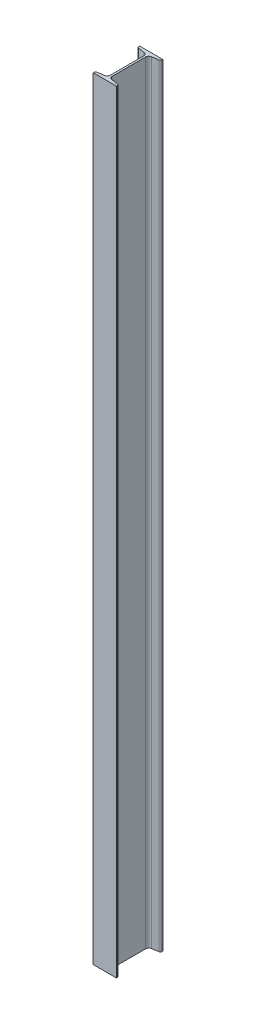
ISO-10303-21;
HEADER;
FILE_DESCRIPTION(('STEP AP214'),'2;1');
FILE_NAME('part.step','',(''),(''),'','','');
FILE_SCHEMA(('AUTOMOTIVE_DESIGN { 1 0 10303 214 1 1 1 1 }'));
ENDSEC;
DATA;
#1=APPLICATION_CONTEXT('core data for automotive mechanical design processes');
#2=APPLICATION_PROTOCOL_DEFINITION('international standard','automotive_design',2000,#1);
#3=PRODUCT_CONTEXT('',#1,'mechanical');
#4=PRODUCT('Part','Part','',(#3));
#5=PRODUCT_RELATED_PRODUCT_CATEGORY('part','',(#4));
#6=PRODUCT_DEFINITION_FORMATION('','',#4);
#7=PRODUCT_DEFINITION_CONTEXT('part definition',#1,'design');
#8=PRODUCT_DEFINITION('design','',#6,#7);
#9=PRODUCT_DEFINITION_SHAPE('','',#8);
#10=(LENGTH_UNIT() NAMED_UNIT(*) SI_UNIT(.MILLI.,.METRE.));
#11=(NAMED_UNIT(*) PLANE_ANGLE_UNIT() SI_UNIT($,.RADIAN.));
#12=(NAMED_UNIT(*) SI_UNIT($,.STERADIAN.) SOLID_ANGLE_UNIT());
#13=UNCERTAINTY_MEASURE_WITH_UNIT(LENGTH_MEASURE(1.E-05),#10,'distance_accuracy_value','');
#14=(GEOMETRIC_REPRESENTATION_CONTEXT(3) GLOBAL_UNCERTAINTY_ASSIGNED_CONTEXT((#13)) GLOBAL_UNIT_ASSIGNED_CONTEXT((#10,
#11,#12)) REPRESENTATION_CONTEXT('',''));
#15=CARTESIAN_POINT('',(0.,0.,0.));
#16=DIRECTION('',(0.,0.,1.));
#17=DIRECTION('',(1.,0.,0.));
#18=AXIS2_PLACEMENT_3D('',#15,#16,#17);
#19=CARTESIAN_POINT('',(-30.,2000.,-60.));
#20=DIRECTION('',(0.,0.,1.));
#21=DIRECTION('',(1.,0.,0.));
#22=AXIS2_PLACEMENT_3D('',#19,#20,#21);
#23=PLANE('',#22);
#24=DIRECTION('',(-1.,0.,0.));
#25=VECTOR('',#24,1.);
#26=CARTESIAN_POINT('',(-30.,0.,-60.));
#27=LINE('',#26,#25);
#28=CARTESIAN_POINT('',(30.,0.,-60.));
#29=VERTEX_POINT('',#28);
#30=CARTESIAN_POINT('',(-30.,0.,-60.));
#31=VERTEX_POINT('',#30);
#32=EDGE_CURVE('E266',#29,#31,#27,.T.);
#33=ORIENTED_EDGE('',*,*,#32,.T.);
#34=DIRECTION('',(0.,-1.,0.));
#35=VECTOR('',#34,1.);
#36=CARTESIAN_POINT('',(-30.,2000.,-60.));
#37=LINE('',#36,#35);
#38=CARTESIAN_POINT('',(-30.,2000.,-60.));
#39=VERTEX_POINT('',#38);
#40=EDGE_CURVE('E13',#39,#31,#37,.T.);
#41=ORIENTED_EDGE('',*,*,#40,.F.);
#42=DIRECTION('',(-1.,0.,0.));
#43=VECTOR('',#42,1.);
#44=CARTESIAN_POINT('',(-30.,2000.,-60.));
#45=LINE('',#44,#43);
#46=CARTESIAN_POINT('',(30.,2000.,-60.));
#47=VERTEX_POINT('',#46);
#48=EDGE_CURVE('E304',#47,#39,#45,.T.);
#49=ORIENTED_EDGE('',*,*,#48,.F.);
#50=DIRECTION('',(0.,-1.,0.));
#51=VECTOR('',#50,1.);
#52=CARTESIAN_POINT('',(30.,2000.,-60.));
#53=LINE('',#52,#51);
#54=EDGE_CURVE('E262',#47,#29,#53,.T.);
#55=ORIENTED_EDGE('',*,*,#54,.T.);
#56=EDGE_LOOP('',(#33,#41,#49,#55));
#57=FACE_BOUND('',#56,.T.);
#58=ADVANCED_FACE('F98',(#57),#23,.F.);
#59=CARTESIAN_POINT('',(-30.,2000.,-58.0800708346734));
#60=DIRECTION('',(1.,0.,0.));
#61=DIRECTION('',(0.,0.,-1.));
#62=AXIS2_PLACEMENT_3D('',#59,#60,#61);
#63=PLANE('',#62);
#64=DIRECTION('',(0.,0.,1.));
#65=VECTOR('',#64,1.);
#66=CARTESIAN_POINT('',(-30.,0.,-58.0800708346734));
#67=LINE('',#66,#65);
#68=CARTESIAN_POINT('',(-30.,0.,-58.0800708346734));
#69=VERTEX_POINT('',#68);
#70=EDGE_CURVE('E269',#31,#69,#67,.T.);
#71=ORIENTED_EDGE('',*,*,#70,.T.);
#72=DIRECTION('',(0.,-1.,0.));
#73=VECTOR('',#72,1.);
#74=CARTESIAN_POINT('',(-30.,2000.,-58.0800708346734));
#75=LINE('',#74,#73);
#76=CARTESIAN_POINT('',(-30.,2000.,-58.0800708346734));
#77=VERTEX_POINT('',#76);
#78=EDGE_CURVE('E106',#77,#69,#75,.T.);
#79=ORIENTED_EDGE('',*,*,#78,.F.);
#80=DIRECTION('',(0.,0.,1.));
#81=VECTOR('',#80,1.);
#82=CARTESIAN_POINT('',(-30.,2000.,-58.0800708346734));
#83=LINE('',#82,#81);
#84=EDGE_CURVE('E193',#39,#77,#83,.T.);
#85=ORIENTED_EDGE('',*,*,#84,.F.);
#86=ORIENTED_EDGE('',*,*,#40,.T.);
#87=EDGE_LOOP('',(#71,#79,#85,#86));
#88=FACE_BOUND('',#87,.T.);
#89=ADVANCED_FACE('F422',(#88),#63,.F.);
#90=CARTESIAN_POINT('',(-26.,2000.,-58.0800708346734));
#91=DIRECTION('',(0.,-1.,0.));
#92=DIRECTION('',(0.,0.,-1.));
#93=AXIS2_PLACEMENT_3D('',#90,#91,#92);
#94=CYLINDRICAL_SURFACE('',#93,4.00000000000001);
#95=CARTESIAN_POINT('',(-26.,0.,-58.0800708346734));
#96=DIRECTION('',(0.,1.,0.));
#97=DIRECTION('',(0.,0.,1.));
#98=AXIS2_PLACEMENT_3D('',#95,#96,#97);
#99=CIRCLE('',#98,4.00000000000001);
#100=CARTESIAN_POINT('',(-26.6576426241585,0.,-54.1345029187848));
#101=VERTEX_POINT('',#100);
#102=EDGE_CURVE('E271',#69,#101,#99,.T.);
#103=ORIENTED_EDGE('',*,*,#102,.T.);
#104=DIRECTION('',(0.,-1.,0.));
#105=VECTOR('',#104,1.);
#106=CARTESIAN_POINT('',(-26.6576426241585,2000.,-54.1345029187848));
#107=LINE('',#106,#105);
#108=CARTESIAN_POINT('',(-26.6576426241585,2000.,-54.1345029187848));
#109=VERTEX_POINT('',#108);
#110=EDGE_CURVE('E347',#109,#101,#107,.T.);
#111=ORIENTED_EDGE('',*,*,#110,.F.);
#112=CARTESIAN_POINT('',(-26.,2000.,-58.0800708346734));
#113=DIRECTION('',(0.,1.,0.));
#114=DIRECTION('',(0.,0.,1.));
#115=AXIS2_PLACEMENT_3D('',#112,#113,#114);
#116=CIRCLE('',#115,4.00000000000001);
#117=EDGE_CURVE('E355',#77,#109,#116,.T.);
#118=ORIENTED_EDGE('',*,*,#117,.F.);
#119=ORIENTED_EDGE('',*,*,#78,.T.);
#120=EDGE_LOOP('',(#103,#111,#118,#119));
#121=FACE_BOUND('',#120,.T.);
#122=ADVANCED_FACE('F353',(#121),#94,.T.);
#123=CARTESIAN_POINT('',(-9.18471475168301,2000.,-51.2221358317773));
#124=DIRECTION('',(0.164410656039623,0.,-0.986391978972163));
#125=DIRECTION('',(-0.986391978972163,0.,-0.164410656039623));
#126=AXIS2_PLACEMENT_3D('',#123,#124,#125);
#127=PLANE('',#126);
#128=DIRECTION('',(0.986391978972163,0.,0.164410656039623));
#129=VECTOR('',#128,1.);
#130=CARTESIAN_POINT('',(-9.18471475168301,0.,-51.2221358317773));
#131=LINE('',#130,#129);
#132=CARTESIAN_POINT('',(-9.18471475168301,0.,-51.2221358317773));
#133=VERTEX_POINT('',#132);
#134=EDGE_CURVE('E273',#101,#133,#131,.T.);
#135=ORIENTED_EDGE('',*,*,#134,.T.);
#136=DIRECTION('',(0.,-1.,0.));
#137=VECTOR('',#136,1.);
#138=CARTESIAN_POINT('',(-9.18471475168301,2000.,-51.2221358317773));
#139=LINE('',#138,#137);
#140=CARTESIAN_POINT('',(-9.18471475168301,2000.,-51.2221358317773));
#141=VERTEX_POINT('',#140);
#142=EDGE_CURVE('E344',#141,#133,#139,.T.);
#143=ORIENTED_EDGE('',*,*,#142,.F.);
#144=DIRECTION('',(0.986391978972163,0.,0.164410656039623));
#145=VECTOR('',#144,1.);
#146=CARTESIAN_POINT('',(-9.18471475168301,2000.,-51.2221358317773));
#147=LINE('',#146,#145);
#148=EDGE_CURVE('E373',#109,#141,#147,.T.);
#149=ORIENTED_EDGE('',*,*,#148,.F.);
#150=ORIENTED_EDGE('',*,*,#110,.T.);
#151=EDGE_LOOP('',(#135,#143,#149,#150));
#152=FACE_BOUND('',#151,.T.);
#153=ADVANCED_FACE('F364',(#152),#127,.F.);
#154=CARTESIAN_POINT('',(-10.5,2000.,-43.331));
#155=DIRECTION('',(0.,-1.,0.));
#156=DIRECTION('',(0.,0.,-1.));
#157=AXIS2_PLACEMENT_3D('',#154,#155,#156);
#158=CYLINDRICAL_SURFACE('',#157,8.);
#159=CARTESIAN_POINT('',(-10.5,0.,-43.331));
#160=DIRECTION('',(0.,-1.,0.));
#161=DIRECTION('',(0.,0.,1.));
#162=AXIS2_PLACEMENT_3D('',#159,#160,#161);
#163=CIRCLE('',#162,8.);
#164=CARTESIAN_POINT('',(-2.5,0.,-43.331));
#165=VERTEX_POINT('',#164);
#166=EDGE_CURVE('E275',#133,#165,#163,.T.);
#167=ORIENTED_EDGE('',*,*,#166,.T.);
#168=DIRECTION('',(0.,-1.,0.));
#169=VECTOR('',#168,1.);
#170=CARTESIAN_POINT('',(-2.5,2000.,-43.331));
#171=LINE('',#170,#169);
#172=CARTESIAN_POINT('',(-2.5,2000.,-43.331));
#173=VERTEX_POINT('',#172);
#174=EDGE_CURVE('E341',#173,#165,#171,.T.);
#175=ORIENTED_EDGE('',*,*,#174,.F.);
#176=CARTESIAN_POINT('',(-10.5,2000.,-43.331));
#177=DIRECTION('',(0.,-1.,0.));
#178=DIRECTION('',(0.,0.,1.));
#179=AXIS2_PLACEMENT_3D('',#176,#177,#178);
#180=CIRCLE('',#179,8.);
#181=EDGE_CURVE('E370',#141,#173,#180,.T.);
#182=ORIENTED_EDGE('',*,*,#181,.F.);
#183=ORIENTED_EDGE('',*,*,#142,.T.);
#184=EDGE_LOOP('',(#167,#175,#182,#183));
#185=FACE_BOUND('',#184,.T.);
#186=ADVANCED_FACE('F368',(#185),#158,.F.);
#187=CARTESIAN_POINT('',(-2.49999999999999,2000.,43.331));
#188=DIRECTION('',(1.,0.,0.));
#189=DIRECTION('',(0.,0.,-1.));
#190=AXIS2_PLACEMENT_3D('',#187,#188,#189);
#191=PLANE('',#190);
#192=DIRECTION('',(0.,0.,1.));
#193=VECTOR('',#192,1.);
#194=CARTESIAN_POINT('',(-2.49999999999999,0.,43.331));
#195=LINE('',#194,#193);
#196=CARTESIAN_POINT('',(-2.49999999999999,0.,43.331));
#197=VERTEX_POINT('',#196);
#198=EDGE_CURVE('E277',#165,#197,#195,.T.);
#199=ORIENTED_EDGE('',*,*,#198,.T.);
#200=DIRECTION('',(0.,-1.,0.));
#201=VECTOR('',#200,1.);
#202=CARTESIAN_POINT('',(-2.49999999999999,2000.,43.331));
#203=LINE('',#202,#201);
#204=CARTESIAN_POINT('',(-2.49999999999999,2000.,43.331));
#205=VERTEX_POINT('',#204);
#206=EDGE_CURVE('E338',#205,#197,#203,.T.);
#207=ORIENTED_EDGE('',*,*,#206,.F.);
#208=DIRECTION('',(0.,0.,1.));
#209=VECTOR('',#208,1.);
#210=CARTESIAN_POINT('',(-2.49999999999999,2000.,43.331));
#211=LINE('',#210,#209);
#212=EDGE_CURVE('E372',#173,#205,#211,.T.);
#213=ORIENTED_EDGE('',*,*,#212,.F.);
#214=ORIENTED_EDGE('',*,*,#174,.T.);
#215=EDGE_LOOP('',(#199,#207,#213,#214));
#216=FACE_BOUND('',#215,.T.);
#217=ADVANCED_FACE('F435',(#216),#191,.F.);
#218=CARTESIAN_POINT('',(-10.5,2000.,43.331));
#219=DIRECTION('',(0.,-1.,0.));
#220=DIRECTION('',(0.,0.,-1.));
#221=AXIS2_PLACEMENT_3D('',#218,#219,#220);
#222=CYLINDRICAL_SURFACE('',#221,8.);
#223=CARTESIAN_POINT('',(-10.5,0.,43.331));
#224=DIRECTION('',(0.,-1.,0.));
#225=DIRECTION('',(0.,0.,1.));
#226=AXIS2_PLACEMENT_3D('',#223,#224,#225);
#227=CIRCLE('',#226,8.);
#228=CARTESIAN_POINT('',(-9.184714751683,0.,51.2221358317773));
#229=VERTEX_POINT('',#228);
#230=EDGE_CURVE('E279',#197,#229,#227,.T.);
#231=ORIENTED_EDGE('',*,*,#230,.T.);
#232=DIRECTION('',(0.,-1.,0.));
#233=VECTOR('',#232,1.);
#234=CARTESIAN_POINT('',(-9.184714751683,2000.,51.2221358317773));
#235=LINE('',#234,#233);
#236=CARTESIAN_POINT('',(-9.184714751683,2000.,51.2221358317773));
#237=VERTEX_POINT('',#236);
#238=EDGE_CURVE('E335',#237,#229,#235,.T.);
#239=ORIENTED_EDGE('',*,*,#238,.F.);
#240=CARTESIAN_POINT('',(-10.5,2000.,43.331));
#241=DIRECTION('',(0.,-1.,0.));
#242=DIRECTION('',(0.,0.,1.));
#243=AXIS2_PLACEMENT_3D('',#240,#241,#242);
#244=CIRCLE('',#243,8.);
#245=EDGE_CURVE('E375',#205,#237,#244,.T.);
#246=ORIENTED_EDGE('',*,*,#245,.F.);
#247=ORIENTED_EDGE('',*,*,#206,.T.);
#248=EDGE_LOOP('',(#231,#239,#246,#247));
#249=FACE_BOUND('',#248,.T.);
#250=ADVANCED_FACE('F438',(#249),#222,.F.);
#251=CARTESIAN_POINT('',(-26.6576426241585,2000.,54.1345029187848));
#252=DIRECTION('',(0.164410656039624,0.,0.986391978972163));
#253=DIRECTION('',(0.986391978972163,0.,-0.164410656039624));
#254=AXIS2_PLACEMENT_3D('',#251,#252,#253);
#255=PLANE('',#254);
#256=DIRECTION('',(-0.986391978972163,0.,0.164410656039624));
#257=VECTOR('',#256,1.);
#258=CARTESIAN_POINT('',(-26.6576426241585,0.,54.1345029187848));
#259=LINE('',#258,#257);
#260=CARTESIAN_POINT('',(-26.6576426241585,0.,54.1345029187848));
#261=VERTEX_POINT('',#260);
#262=EDGE_CURVE('E281',#229,#261,#259,.T.);
#263=ORIENTED_EDGE('',*,*,#262,.T.);
#264=DIRECTION('',(0.,-1.,0.));
#265=VECTOR('',#264,1.);
#266=CARTESIAN_POINT('',(-26.6576426241585,2000.,54.1345029187848));
#267=LINE('',#266,#265);
#268=CARTESIAN_POINT('',(-26.6576426241585,2000.,54.1345029187848));
#269=VERTEX_POINT('',#268);
#270=EDGE_CURVE('E332',#269,#261,#267,.T.);
#271=ORIENTED_EDGE('',*,*,#270,.F.);
#272=DIRECTION('',(-0.986391978972163,0.,0.164410656039624));
#273=VECTOR('',#272,1.);
#274=CARTESIAN_POINT('',(-26.6576426241585,2000.,54.1345029187848));
#275=LINE('',#274,#273);
#276=EDGE_CURVE('E381',#237,#269,#275,.T.);
#277=ORIENTED_EDGE('',*,*,#276,.F.);
#278=ORIENTED_EDGE('',*,*,#238,.T.);
#279=EDGE_LOOP('',(#263,#271,#277,#278));
#280=FACE_BOUND('',#279,.T.);
#281=ADVANCED_FACE('F442',(#280),#255,.F.);
#282=CARTESIAN_POINT('',(-26.,2000.,58.0800708346735));
#283=DIRECTION('',(0.,-1.,0.));
#284=DIRECTION('',(0.,0.,-1.));
#285=AXIS2_PLACEMENT_3D('',#282,#283,#284);
#286=CYLINDRICAL_SURFACE('',#285,4.);
#287=CARTESIAN_POINT('',(-26.,0.,58.0800708346735));
#288=DIRECTION('',(0.,1.,0.));
#289=DIRECTION('',(0.,0.,1.));
#290=AXIS2_PLACEMENT_3D('',#287,#288,#289);
#291=CIRCLE('',#290,4.);
#292=CARTESIAN_POINT('',(-30.,0.,58.0800708346735));
#293=VERTEX_POINT('',#292);
#294=EDGE_CURVE('E283',#261,#293,#291,.T.);
#295=ORIENTED_EDGE('',*,*,#294,.T.);
#296=DIRECTION('',(0.,-1.,0.));
#297=VECTOR('',#296,1.);
#298=CARTESIAN_POINT('',(-30.,2000.,58.0800708346735));
#299=LINE('',#298,#297);
#300=CARTESIAN_POINT('',(-30.,2000.,58.0800708346735));
#301=VERTEX_POINT('',#300);
#302=EDGE_CURVE('E329',#301,#293,#299,.T.);
#303=ORIENTED_EDGE('',*,*,#302,.F.);
#304=CARTESIAN_POINT('',(-26.,2000.,58.0800708346735));
#305=DIRECTION('',(0.,1.,0.));
#306=DIRECTION('',(0.,0.,1.));
#307=AXIS2_PLACEMENT_3D('',#304,#305,#306);
#308=CIRCLE('',#307,4.);
#309=EDGE_CURVE('E383',#269,#301,#308,.T.);
#310=ORIENTED_EDGE('',*,*,#309,.F.);
#311=ORIENTED_EDGE('',*,*,#270,.T.);
#312=EDGE_LOOP('',(#295,#303,#310,#311));
#313=FACE_BOUND('',#312,.T.);
#314=ADVANCED_FACE('F446',(#313),#286,.T.);
#315=CARTESIAN_POINT('',(-30.,2000.,60.));
#316=DIRECTION('',(1.,0.,0.));
#317=DIRECTION('',(0.,0.,-1.));
#318=AXIS2_PLACEMENT_3D('',#315,#316,#317);
#319=PLANE('',#318);
#320=DIRECTION('',(0.,0.,1.));
#321=VECTOR('',#320,1.);
#322=CARTESIAN_POINT('',(-30.,0.,60.));
#323=LINE('',#322,#321);
#324=CARTESIAN_POINT('',(-30.,0.,60.));
#325=VERTEX_POINT('',#324);
#326=EDGE_CURVE('E285',#293,#325,#323,.T.);
#327=ORIENTED_EDGE('',*,*,#326,.T.);
#328=DIRECTION('',(0.,-1.,0.));
#329=VECTOR('',#328,1.);
#330=CARTESIAN_POINT('',(-30.,2000.,60.));
#331=LINE('',#330,#329);
#332=CARTESIAN_POINT('',(-30.,2000.,60.));
#333=VERTEX_POINT('',#332);
#334=EDGE_CURVE('E326',#333,#325,#331,.T.);
#335=ORIENTED_EDGE('',*,*,#334,.F.);
#336=DIRECTION('',(0.,0.,1.));
#337=VECTOR('',#336,1.);
#338=CARTESIAN_POINT('',(-30.,2000.,60.));
#339=LINE('',#338,#337);
#340=EDGE_CURVE('E385',#301,#333,#339,.T.);
#341=ORIENTED_EDGE('',*,*,#340,.F.);
#342=ORIENTED_EDGE('',*,*,#302,.T.);
#343=EDGE_LOOP('',(#327,#335,#341,#342));
#344=FACE_BOUND('',#343,.T.);
#345=ADVANCED_FACE('F450',(#344),#319,.F.);
#346=CARTESIAN_POINT('',(30.,2000.,60.));
#347=DIRECTION('',(0.,0.,-1.));
#348=DIRECTION('',(-1.,0.,0.));
#349=AXIS2_PLACEMENT_3D('',#346,#347,#348);
#350=PLANE('',#349);
#351=DIRECTION('',(1.,0.,0.));
#352=VECTOR('',#351,1.);
#353=CARTESIAN_POINT('',(30.,0.,60.));
#354=LINE('',#353,#352);
#355=CARTESIAN_POINT('',(30.,0.,60.));
#356=VERTEX_POINT('',#355);
#357=EDGE_CURVE('E287',#325,#356,#354,.T.);
#358=ORIENTED_EDGE('',*,*,#357,.T.);
#359=DIRECTION('',(0.,-1.,0.));
#360=VECTOR('',#359,1.);
#361=CARTESIAN_POINT('',(30.,2000.,60.));
#362=LINE('',#361,#360);
#363=CARTESIAN_POINT('',(30.,2000.,60.));
#364=VERTEX_POINT('',#363);
#365=EDGE_CURVE('E323',#364,#356,#362,.T.);
#366=ORIENTED_EDGE('',*,*,#365,.F.);
#367=DIRECTION('',(1.,0.,0.));
#368=VECTOR('',#367,1.);
#369=CARTESIAN_POINT('',(30.,2000.,60.));
#370=LINE('',#369,#368);
#371=EDGE_CURVE('E387',#333,#364,#370,.T.);
#372=ORIENTED_EDGE('',*,*,#371,.F.);
#373=ORIENTED_EDGE('',*,*,#334,.T.);
#374=EDGE_LOOP('',(#358,#366,#372,#373));
#375=FACE_BOUND('',#374,.T.);
#376=ADVANCED_FACE('F454',(#375),#350,.F.);
#377=CARTESIAN_POINT('',(30.,2000.,58.0800708346735));
#378=DIRECTION('',(-1.,0.,0.));
#379=DIRECTION('',(0.,0.,1.));
#380=AXIS2_PLACEMENT_3D('',#377,#378,#379);
#381=PLANE('',#380);
#382=DIRECTION('',(0.,0.,-1.));
#383=VECTOR('',#382,1.);
#384=CARTESIAN_POINT('',(30.,0.,58.0800708346735));
#385=LINE('',#384,#383);
#386=CARTESIAN_POINT('',(30.,0.,58.0800708346735));
#387=VERTEX_POINT('',#386);
#388=EDGE_CURVE('E289',#356,#387,#385,.T.);
#389=ORIENTED_EDGE('',*,*,#388,.T.);
#390=DIRECTION('',(0.,-1.,0.));
#391=VECTOR('',#390,1.);
#392=CARTESIAN_POINT('',(30.,2000.,58.0800708346735));
#393=LINE('',#392,#391);
#394=CARTESIAN_POINT('',(30.,2000.,58.0800708346735));
#395=VERTEX_POINT('',#394);
#396=EDGE_CURVE('E320',#395,#387,#393,.T.);
#397=ORIENTED_EDGE('',*,*,#396,.F.);
#398=DIRECTION('',(0.,0.,-1.));
#399=VECTOR('',#398,1.);
#400=CARTESIAN_POINT('',(30.,2000.,58.0800708346735));
#401=LINE('',#400,#399);
#402=EDGE_CURVE('E389',#364,#395,#401,.T.);
#403=ORIENTED_EDGE('',*,*,#402,.F.);
#404=ORIENTED_EDGE('',*,*,#365,.T.);
#405=EDGE_LOOP('',(#389,#397,#403,#404));
#406=FACE_BOUND('',#405,.T.);
#407=ADVANCED_FACE('F458',(#406),#381,.F.);
#408=CARTESIAN_POINT('',(26.,2000.,58.0800708346735));
#409=DIRECTION('',(0.,-1.,0.));
#410=DIRECTION('',(0.,0.,-1.));
#411=AXIS2_PLACEMENT_3D('',#408,#409,#410);
#412=CYLINDRICAL_SURFACE('',#411,4.);
#413=CARTESIAN_POINT('',(26.,0.,58.0800708346735));
#414=DIRECTION('',(0.,1.,0.));
#415=DIRECTION('',(0.,0.,-1.));
#416=AXIS2_PLACEMENT_3D('',#413,#414,#415);
#417=CIRCLE('',#416,4.);
#418=CARTESIAN_POINT('',(26.6576426241585,0.,54.1345029187848));
#419=VERTEX_POINT('',#418);
#420=EDGE_CURVE('E291',#387,#419,#417,.T.);
#421=ORIENTED_EDGE('',*,*,#420,.T.);
#422=DIRECTION('',(0.,-1.,0.));
#423=VECTOR('',#422,1.);
#424=CARTESIAN_POINT('',(26.6576426241585,2000.,54.1345029187848));
#425=LINE('',#424,#423);
#426=CARTESIAN_POINT('',(26.6576426241585,2000.,54.1345029187848));
#427=VERTEX_POINT('',#426);
#428=EDGE_CURVE('E317',#427,#419,#425,.T.);
#429=ORIENTED_EDGE('',*,*,#428,.F.);
#430=CARTESIAN_POINT('',(26.,2000.,58.0800708346735));
#431=DIRECTION('',(0.,1.,0.));
#432=DIRECTION('',(0.,0.,-1.));
#433=AXIS2_PLACEMENT_3D('',#430,#431,#432);
#434=CIRCLE('',#433,4.);
#435=EDGE_CURVE('E391',#395,#427,#434,.T.);
#436=ORIENTED_EDGE('',*,*,#435,.F.);
#437=ORIENTED_EDGE('',*,*,#396,.T.);
#438=EDGE_LOOP('',(#421,#429,#436,#437));
#439=FACE_BOUND('',#438,.T.);
#440=ADVANCED_FACE('F462',(#439),#412,.T.);
#441=CARTESIAN_POINT('',(9.18471475168301,2000.,51.2221358317773));
#442=DIRECTION('',(-0.164410656039624,0.,0.986391978972163));
#443=DIRECTION('',(0.986391978972163,0.,0.164410656039624));
#444=AXIS2_PLACEMENT_3D('',#441,#442,#443);
#445=PLANE('',#444);
#446=DIRECTION('',(-0.986391978972163,0.,-0.164410656039624));
#447=VECTOR('',#446,1.);
#448=CARTESIAN_POINT('',(9.18471475168301,0.,51.2221358317773));
#449=LINE('',#448,#447);
#450=CARTESIAN_POINT('',(9.18471475168301,0.,51.2221358317773));
#451=VERTEX_POINT('',#450);
#452=EDGE_CURVE('E293',#419,#451,#449,.T.);
#453=ORIENTED_EDGE('',*,*,#452,.T.);
#454=DIRECTION('',(0.,-1.,0.));
#455=VECTOR('',#454,1.);
#456=CARTESIAN_POINT('',(9.18471475168301,2000.,51.2221358317773));
#457=LINE('',#456,#455);
#458=CARTESIAN_POINT('',(9.18471475168301,2000.,51.2221358317773));
#459=VERTEX_POINT('',#458);
#460=EDGE_CURVE('E314',#459,#451,#457,.T.);
#461=ORIENTED_EDGE('',*,*,#460,.F.);
#462=DIRECTION('',(-0.986391978972163,0.,-0.164410656039624));
#463=VECTOR('',#462,1.);
#464=CARTESIAN_POINT('',(9.18471475168301,2000.,51.2221358317773));
#465=LINE('',#464,#463);
#466=EDGE_CURVE('E393',#427,#459,#465,.T.);
#467=ORIENTED_EDGE('',*,*,#466,.F.);
#468=ORIENTED_EDGE('',*,*,#428,.T.);
#469=EDGE_LOOP('',(#453,#461,#467,#468));
#470=FACE_BOUND('',#469,.T.);
#471=ADVANCED_FACE('F466',(#470),#445,.F.);
#472=CARTESIAN_POINT('',(10.5,2000.,43.331));
#473=DIRECTION('',(0.,-1.,0.));
#474=DIRECTION('',(0.,0.,-1.));
#475=AXIS2_PLACEMENT_3D('',#472,#473,#474);
#476=CYLINDRICAL_SURFACE('',#475,8.);
#477=CARTESIAN_POINT('',(10.5,0.,43.331));
#478=DIRECTION('',(0.,-1.,0.));
#479=DIRECTION('',(0.,0.,1.));
#480=AXIS2_PLACEMENT_3D('',#477,#478,#479);
#481=CIRCLE('',#480,8.);
#482=CARTESIAN_POINT('',(2.5,0.,43.331));
#483=VERTEX_POINT('',#482);
#484=EDGE_CURVE('E295',#451,#483,#481,.T.);
#485=ORIENTED_EDGE('',*,*,#484,.T.);
#486=DIRECTION('',(0.,-1.,0.));
#487=VECTOR('',#486,1.);
#488=CARTESIAN_POINT('',(2.5,2000.,43.331));
#489=LINE('',#488,#487);
#490=CARTESIAN_POINT('',(2.5,2000.,43.331));
#491=VERTEX_POINT('',#490);
#492=EDGE_CURVE('E311',#491,#483,#489,.T.);
#493=ORIENTED_EDGE('',*,*,#492,.F.);
#494=CARTESIAN_POINT('',(10.5,2000.,43.331));
#495=DIRECTION('',(0.,-1.,0.));
#496=DIRECTION('',(0.,0.,1.));
#497=AXIS2_PLACEMENT_3D('',#494,#495,#496);
#498=CIRCLE('',#497,8.);
#499=EDGE_CURVE('E395',#459,#491,#498,.T.);
#500=ORIENTED_EDGE('',*,*,#499,.F.);
#501=ORIENTED_EDGE('',*,*,#460,.T.);
#502=EDGE_LOOP('',(#485,#493,#500,#501));
#503=FACE_BOUND('',#502,.T.);
#504=ADVANCED_FACE('F470',(#503),#476,.F.);
#505=CARTESIAN_POINT('',(2.5,2000.,-43.331));
#506=DIRECTION('',(-1.,0.,0.));
#507=DIRECTION('',(0.,0.,1.));
#508=AXIS2_PLACEMENT_3D('',#505,#506,#507);
#509=PLANE('',#508);
#510=DIRECTION('',(0.,0.,-1.));
#511=VECTOR('',#510,1.);
#512=CARTESIAN_POINT('',(2.5,0.,-43.331));
#513=LINE('',#512,#511);
#514=CARTESIAN_POINT('',(2.5,0.,-43.331));
#515=VERTEX_POINT('',#514);
#516=EDGE_CURVE('E297',#483,#515,#513,.T.);
#517=ORIENTED_EDGE('',*,*,#516,.T.);
#518=DIRECTION('',(0.,-1.,0.));
#519=VECTOR('',#518,1.);
#520=CARTESIAN_POINT('',(2.5,2000.,-43.331));
#521=LINE('',#520,#519);
#522=CARTESIAN_POINT('',(2.5,2000.,-43.331));
#523=VERTEX_POINT('',#522);
#524=EDGE_CURVE('E308',#523,#515,#521,.T.);
#525=ORIENTED_EDGE('',*,*,#524,.F.);
#526=DIRECTION('',(0.,0.,-1.));
#527=VECTOR('',#526,1.);
#528=CARTESIAN_POINT('',(2.5,2000.,-43.331));
#529=LINE('',#528,#527);
#530=EDGE_CURVE('E397',#491,#523,#529,.T.);
#531=ORIENTED_EDGE('',*,*,#530,.F.);
#532=ORIENTED_EDGE('',*,*,#492,.T.);
#533=EDGE_LOOP('',(#517,#525,#531,#532));
#534=FACE_BOUND('',#533,.T.);
#535=ADVANCED_FACE('F403',(#534),#509,.F.);
#536=CARTESIAN_POINT('',(10.5,2000.,-43.331));
#537=DIRECTION('',(0.,-1.,0.));
#538=DIRECTION('',(0.,0.,-1.));
#539=AXIS2_PLACEMENT_3D('',#536,#537,#538);
#540=CYLINDRICAL_SURFACE('',#539,8.);
#541=CARTESIAN_POINT('',(10.5,0.,-43.331));
#542=DIRECTION('',(0.,-1.,0.));
#543=DIRECTION('',(0.,0.,1.));
#544=AXIS2_PLACEMENT_3D('',#541,#542,#543);
#545=CIRCLE('',#544,8.);
#546=CARTESIAN_POINT('',(9.18471475168302,0.,-51.2221358317773));
#547=VERTEX_POINT('',#546);
#548=EDGE_CURVE('E299',#515,#547,#545,.T.);
#549=ORIENTED_EDGE('',*,*,#548,.T.);
#550=DIRECTION('',(0.,-1.,0.));
#551=VECTOR('',#550,1.);
#552=CARTESIAN_POINT('',(9.18471475168302,2000.,-51.2221358317773));
#553=LINE('',#552,#551);
#554=CARTESIAN_POINT('',(9.18471475168302,2000.,-51.2221358317773));
#555=VERTEX_POINT('',#554);
#556=EDGE_CURVE('E257',#555,#547,#553,.T.);
#557=ORIENTED_EDGE('',*,*,#556,.F.);
#558=CARTESIAN_POINT('',(10.5,2000.,-43.331));
#559=DIRECTION('',(0.,-1.,0.));
#560=DIRECTION('',(0.,0.,1.));
#561=AXIS2_PLACEMENT_3D('',#558,#559,#560);
#562=CIRCLE('',#561,8.);
#563=EDGE_CURVE('E248',#523,#555,#562,.T.);
#564=ORIENTED_EDGE('',*,*,#563,.F.);
#565=ORIENTED_EDGE('',*,*,#524,.T.);
#566=EDGE_LOOP('',(#549,#557,#564,#565));
#567=FACE_BOUND('',#566,.T.);
#568=ADVANCED_FACE('F407',(#567),#540,.F.);
#569=CARTESIAN_POINT('',(26.6576426241585,2000.,-54.1345029187848));
#570=DIRECTION('',(-0.164410656039623,0.,-0.986391978972163));
#571=DIRECTION('',(-0.986391978972163,0.,0.164410656039623));
#572=AXIS2_PLACEMENT_3D('',#569,#570,#571);
#573=PLANE('',#572);
#574=DIRECTION('',(0.986391978972163,0.,-0.164410656039623));
#575=VECTOR('',#574,1.);
#576=CARTESIAN_POINT('',(26.6576426241585,0.,-54.1345029187848));
#577=LINE('',#576,#575);
#578=CARTESIAN_POINT('',(26.6576426241585,0.,-54.1345029187848));
#579=VERTEX_POINT('',#578);
#580=EDGE_CURVE('E256',#547,#579,#577,.T.);
#581=ORIENTED_EDGE('',*,*,#580,.T.);
#582=DIRECTION('',(0.,-1.,0.));
#583=VECTOR('',#582,1.);
#584=CARTESIAN_POINT('',(26.6576426241585,2000.,-54.1345029187848));
#585=LINE('',#584,#583);
#586=CARTESIAN_POINT('',(26.6576426241585,2000.,-54.1345029187848));
#587=VERTEX_POINT('',#586);
#588=EDGE_CURVE('E253',#587,#579,#585,.T.);
#589=ORIENTED_EDGE('',*,*,#588,.F.);
#590=DIRECTION('',(0.986391978972163,0.,-0.164410656039623));
#591=VECTOR('',#590,1.);
#592=CARTESIAN_POINT('',(26.6576426241585,2000.,-54.1345029187848));
#593=LINE('',#592,#591);
#594=EDGE_CURVE('E242',#555,#587,#593,.T.);
#595=ORIENTED_EDGE('',*,*,#594,.F.);
#596=ORIENTED_EDGE('',*,*,#556,.T.);
#597=EDGE_LOOP('',(#581,#589,#595,#596));
#598=FACE_BOUND('',#597,.T.);
#599=ADVANCED_FACE('F254',(#598),#573,.F.);
#600=CARTESIAN_POINT('',(26.,2000.,-58.0800708346734));
#601=DIRECTION('',(0.,-1.,0.));
#602=DIRECTION('',(0.,0.,-1.));
#603=AXIS2_PLACEMENT_3D('',#600,#601,#602);
#604=CYLINDRICAL_SURFACE('',#603,4.);
#605=CARTESIAN_POINT('',(26.,0.,-58.0800708346734));
#606=DIRECTION('',(0.,1.,0.));
#607=DIRECTION('',(0.,0.,-1.));
#608=AXIS2_PLACEMENT_3D('',#605,#606,#607);
#609=CIRCLE('',#608,4.);
#610=CARTESIAN_POINT('',(30.,0.,-58.0800708346734));
#611=VERTEX_POINT('',#610);
#612=EDGE_CURVE('E179',#579,#611,#609,.T.);
#613=ORIENTED_EDGE('',*,*,#612,.T.);
#614=DIRECTION('',(0.,-1.,0.));
#615=VECTOR('',#614,1.);
#616=CARTESIAN_POINT('',(30.,2000.,-58.0800708346734));
#617=LINE('',#616,#615);
#618=CARTESIAN_POINT('',(30.,2000.,-58.0800708346734));
#619=VERTEX_POINT('',#618);
#620=EDGE_CURVE('E258',#619,#611,#617,.T.);
#621=ORIENTED_EDGE('',*,*,#620,.F.);
#622=CARTESIAN_POINT('',(26.,2000.,-58.0800708346734));
#623=DIRECTION('',(0.,1.,0.));
#624=DIRECTION('',(0.,0.,-1.));
#625=AXIS2_PLACEMENT_3D('',#622,#623,#624);
#626=CIRCLE('',#625,4.);
#627=EDGE_CURVE('E246',#587,#619,#626,.T.);
#628=ORIENTED_EDGE('',*,*,#627,.F.);
#629=ORIENTED_EDGE('',*,*,#588,.T.);
#630=EDGE_LOOP('',(#613,#621,#628,#629));
#631=FACE_BOUND('',#630,.T.);
#632=ADVANCED_FACE('F260',(#631),#604,.T.);
#633=CARTESIAN_POINT('',(30.,2000.,-60.));
#634=DIRECTION('',(-1.,0.,0.));
#635=DIRECTION('',(0.,0.,1.));
#636=AXIS2_PLACEMENT_3D('',#633,#634,#635);
#637=PLANE('',#636);
#638=DIRECTION('',(0.,0.,-1.));
#639=VECTOR('',#638,1.);
#640=CARTESIAN_POINT('',(30.,0.,-60.));
#641=LINE('',#640,#639);
#642=EDGE_CURVE('E185',#611,#29,#641,.T.);
#643=ORIENTED_EDGE('',*,*,#642,.T.);
#644=ORIENTED_EDGE('',*,*,#54,.F.);
#645=DIRECTION('',(0.,0.,-1.));
#646=VECTOR('',#645,1.);
#647=CARTESIAN_POINT('',(30.,2000.,-60.));
#648=LINE('',#647,#646);
#649=EDGE_CURVE('E114',#619,#47,#648,.T.);
#650=ORIENTED_EDGE('',*,*,#649,.F.);
#651=ORIENTED_EDGE('',*,*,#620,.T.);
#652=EDGE_LOOP('',(#643,#644,#650,#651));
#653=FACE_BOUND('',#652,.T.);
#654=ADVANCED_FACE('F411',(#653),#637,.F.);
#655=CARTESIAN_POINT('',(26.,2000.,-58.0800708346734));
#656=DIRECTION('',(0.,-1.,0.));
#657=DIRECTION('',(0.,0.,-1.));
#658=AXIS2_PLACEMENT_3D('',#655,#656,#657);
#659=PLANE('',#658);
#660=ORIENTED_EDGE('',*,*,#48,.T.);
#661=ORIENTED_EDGE('',*,*,#84,.T.);
#662=ORIENTED_EDGE('',*,*,#117,.T.);
#663=ORIENTED_EDGE('',*,*,#148,.T.);
#664=ORIENTED_EDGE('',*,*,#181,.T.);
#665=ORIENTED_EDGE('',*,*,#212,.T.);
#666=ORIENTED_EDGE('',*,*,#245,.T.);
#667=ORIENTED_EDGE('',*,*,#276,.T.);
#668=ORIENTED_EDGE('',*,*,#309,.T.);
#669=ORIENTED_EDGE('',*,*,#340,.T.);
#670=ORIENTED_EDGE('',*,*,#371,.T.);
#671=ORIENTED_EDGE('',*,*,#402,.T.);
#672=ORIENTED_EDGE('',*,*,#435,.T.);
#673=ORIENTED_EDGE('',*,*,#466,.T.);
#674=ORIENTED_EDGE('',*,*,#499,.T.);
#675=ORIENTED_EDGE('',*,*,#530,.T.);
#676=ORIENTED_EDGE('',*,*,#563,.T.);
#677=ORIENTED_EDGE('',*,*,#594,.T.);
#678=ORIENTED_EDGE('',*,*,#627,.T.);
#679=ORIENTED_EDGE('',*,*,#649,.T.);
#680=EDGE_LOOP('',(#660,#661,#662,#663,#664,#665,#666,#667,#668,#669,#670,#671,#672,#673,#674,
#675,#676,#677,#678,#679));
#681=FACE_BOUND('',#680,.T.);
#682=ADVANCED_FACE('F244',(#681),#659,.F.);
#683=CARTESIAN_POINT('',(26.,0.,-58.0800708346734));
#684=DIRECTION('',(0.,-1.,0.));
#685=DIRECTION('',(0.,0.,-1.));
#686=AXIS2_PLACEMENT_3D('',#683,#684,#685);
#687=PLANE('',#686);
#688=ORIENTED_EDGE('',*,*,#32,.F.);
#689=ORIENTED_EDGE('',*,*,#642,.F.);
#690=ORIENTED_EDGE('',*,*,#612,.F.);
#691=ORIENTED_EDGE('',*,*,#580,.F.);
#692=ORIENTED_EDGE('',*,*,#548,.F.);
#693=ORIENTED_EDGE('',*,*,#516,.F.);
#694=ORIENTED_EDGE('',*,*,#484,.F.);
#695=ORIENTED_EDGE('',*,*,#452,.F.);
#696=ORIENTED_EDGE('',*,*,#420,.F.);
#697=ORIENTED_EDGE('',*,*,#388,.F.);
#698=ORIENTED_EDGE('',*,*,#357,.F.);
#699=ORIENTED_EDGE('',*,*,#326,.F.);
#700=ORIENTED_EDGE('',*,*,#294,.F.);
#701=ORIENTED_EDGE('',*,*,#262,.F.);
#702=ORIENTED_EDGE('',*,*,#230,.F.);
#703=ORIENTED_EDGE('',*,*,#198,.F.);
#704=ORIENTED_EDGE('',*,*,#166,.F.);
#705=ORIENTED_EDGE('',*,*,#134,.F.);
#706=ORIENTED_EDGE('',*,*,#102,.F.);
#707=ORIENTED_EDGE('',*,*,#70,.F.);
#708=EDGE_LOOP('',(#688,#689,#690,#691,#692,#693,#694,#695,#696,#697,#698,#699,#700,#701,#702,
#703,#704,#705,#706,#707));
#709=FACE_BOUND('',#708,.T.);
#710=ADVANCED_FACE('F359',(#709),#687,.T.);
#711=CLOSED_SHELL('',(#58,#89,#122,#153,#186,#217,#250,#281,#314,#345,#376,#407,#440,#471,#504,
#535,#568,#599,#632,#654,#682,#710));
#712=MANIFOLD_SOLID_BREP('B2',#711);
#713=ADVANCED_BREP_SHAPE_REPRESENTATION('',(#18,#712),#14);
#714=SHAPE_DEFINITION_REPRESENTATION(#9,#713);
ENDSEC;
END-ISO-10303-21;
